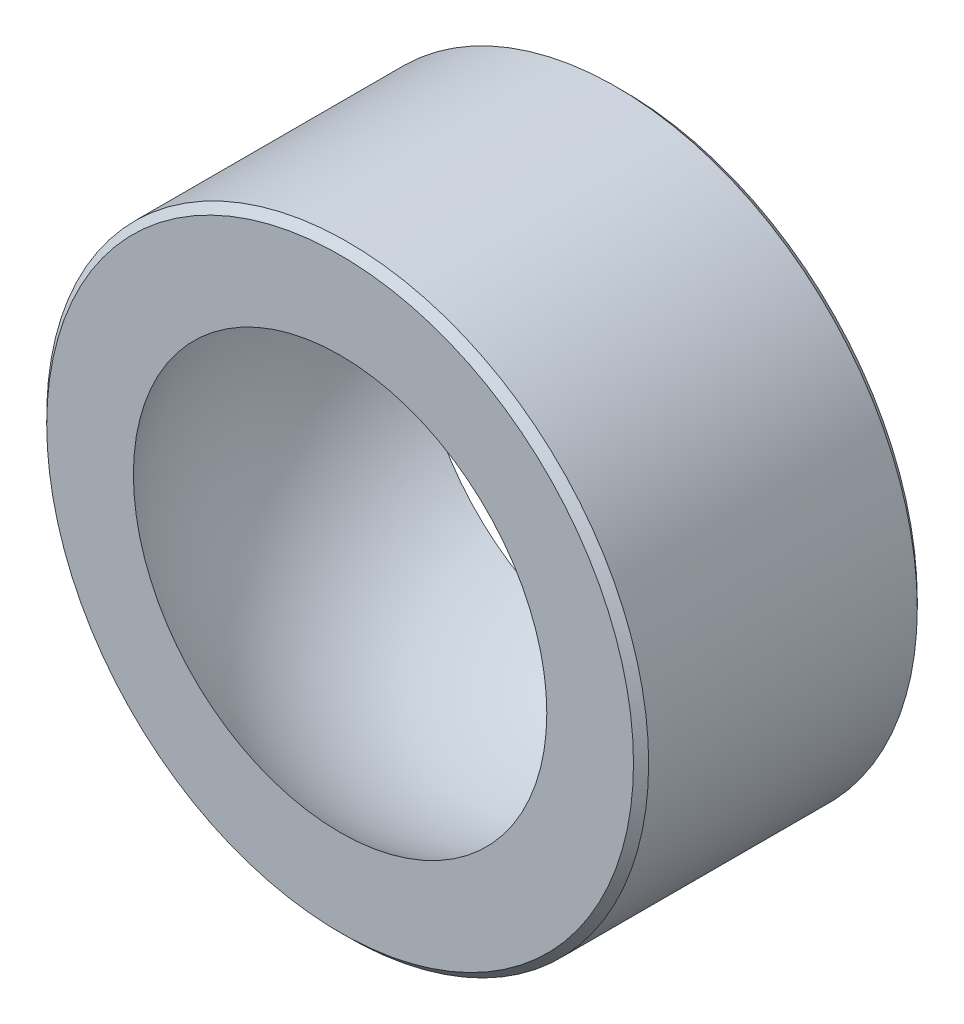
ISO-10303-21;
HEADER;
FILE_DESCRIPTION(('STEP AP214'),'2;1');
FILE_NAME('part.step','',(''),(''),'','','');
FILE_SCHEMA(('AUTOMOTIVE_DESIGN { 1 0 10303 214 1 1 1 1 }'));
ENDSEC;
DATA;
#1=APPLICATION_CONTEXT('core data for automotive mechanical design processes');
#2=APPLICATION_PROTOCOL_DEFINITION('international standard','automotive_design',2000,#1);
#3=PRODUCT_CONTEXT('',#1,'mechanical');
#4=PRODUCT('Part','Part','',(#3));
#5=PRODUCT_RELATED_PRODUCT_CATEGORY('part','',(#4));
#6=PRODUCT_DEFINITION_FORMATION('','',#4);
#7=PRODUCT_DEFINITION_CONTEXT('part definition',#1,'design');
#8=PRODUCT_DEFINITION('design','',#6,#7);
#9=PRODUCT_DEFINITION_SHAPE('','',#8);
#10=(LENGTH_UNIT() NAMED_UNIT(*) SI_UNIT(.MILLI.,.METRE.));
#11=(NAMED_UNIT(*) PLANE_ANGLE_UNIT() SI_UNIT($,.RADIAN.));
#12=(NAMED_UNIT(*) SI_UNIT($,.STERADIAN.) SOLID_ANGLE_UNIT());
#13=UNCERTAINTY_MEASURE_WITH_UNIT(LENGTH_MEASURE(1.E-05),#10,'distance_accuracy_value','');
#14=(GEOMETRIC_REPRESENTATION_CONTEXT(3) GLOBAL_UNCERTAINTY_ASSIGNED_CONTEXT((#13)) GLOBAL_UNIT_ASSIGNED_CONTEXT((#10,
#11,#12)) REPRESENTATION_CONTEXT('',''));
#15=CARTESIAN_POINT('',(0.,0.,0.));
#16=DIRECTION('',(0.,0.,1.));
#17=DIRECTION('',(1.,0.,0.));
#18=AXIS2_PLACEMENT_3D('',#15,#16,#17);
#19=CARTESIAN_POINT('',(0.,0.,-5.6134));
#20=DIRECTION('',(0.,0.,1.));
#21=DIRECTION('',(1.,0.,0.));
#22=AXIS2_PLACEMENT_3D('',#19,#20,#21);
#23=PLANE('',#22);
#24=CARTESIAN_POINT('',(0.,0.,-5.6134));
#25=DIRECTION('',(0.,0.,1.));
#26=DIRECTION('',(1.,0.,0.));
#27=AXIS2_PLACEMENT_3D('',#24,#25,#26);
#28=CIRCLE('',#27,11.60625);
#29=CARTESIAN_POINT('',(11.60625,0.,-5.6134));
#30=VERTEX_POINT('',#29);
#31=EDGE_CURVE('E10',#30,#30,#28,.F.);
#32=ORIENTED_EDGE('',*,*,#31,.T.);
#33=EDGE_LOOP('',(#32));
#34=FACE_BOUND('',#33,.T.);
#35=CARTESIAN_POINT('',(0.,0.,-5.6134));
#36=DIRECTION('',(0.,0.,1.));
#37=DIRECTION('',(1.,0.,0.));
#38=AXIS2_PLACEMENT_3D('',#35,#36,#37);
#39=CIRCLE('',#38,8.17742931060856);
#40=CARTESIAN_POINT('',(8.17742931060856,0.,-5.6134));
#41=VERTEX_POINT('',#40);
#42=EDGE_CURVE('E50',#41,#41,#39,.F.);
#43=ORIENTED_EDGE('',*,*,#42,.F.);
#44=EDGE_LOOP('',(#43));
#45=FACE_BOUND('',#44,.T.);
#46=ADVANCED_FACE('F30',(#34,#45),#23,.F.);
#47=CARTESIAN_POINT('',(0.,0.,5.6134));
#48=DIRECTION('',(0.,0.,1.));
#49=DIRECTION('',(1.,0.,0.));
#50=AXIS2_PLACEMENT_3D('',#47,#48,#49);
#51=PLANE('',#50);
#52=CARTESIAN_POINT('',(0.,0.,5.6134));
#53=DIRECTION('',(0.,0.,1.));
#54=DIRECTION('',(1.,0.,0.));
#55=AXIS2_PLACEMENT_3D('',#52,#53,#54);
#56=CIRCLE('',#55,11.60625);
#57=CARTESIAN_POINT('',(11.60625,0.,5.6134));
#58=VERTEX_POINT('',#57);
#59=EDGE_CURVE('E45',#58,#58,#56,.T.);
#60=ORIENTED_EDGE('',*,*,#59,.T.);
#61=EDGE_LOOP('',(#60));
#62=FACE_BOUND('',#61,.T.);
#63=CARTESIAN_POINT('',(0.,0.,5.6134));
#64=DIRECTION('',(0.,0.,1.));
#65=DIRECTION('',(1.,0.,0.));
#66=AXIS2_PLACEMENT_3D('',#63,#64,#65);
#67=CIRCLE('',#66,8.17742931060856);
#68=CARTESIAN_POINT('',(8.17742931060856,0.,5.6134));
#69=VERTEX_POINT('',#68);
#70=EDGE_CURVE('E51',#69,#69,#67,.F.);
#71=ORIENTED_EDGE('',*,*,#70,.T.);
#72=EDGE_LOOP('',(#71));
#73=FACE_BOUND('',#72,.T.);
#74=ADVANCED_FACE('F60',(#62,#73),#51,.T.);
#75=CARTESIAN_POINT('',(0.,0.,-5.6134));
#76=DIRECTION('',(0.,0.,1.));
#77=DIRECTION('',(1.,0.,0.));
#78=AXIS2_PLACEMENT_3D('',#75,#76,#77);
#79=CYLINDRICAL_SURFACE('',#78,11.90625);
#80=CARTESIAN_POINT('',(0.,0.,5.3134));
#81=DIRECTION('',(0.,0.,1.));
#82=DIRECTION('',(1.,0.,0.));
#83=AXIS2_PLACEMENT_3D('',#80,#81,#82);
#84=CIRCLE('',#83,11.90625);
#85=CARTESIAN_POINT('',(11.90625,0.,5.3134));
#86=VERTEX_POINT('',#85);
#87=EDGE_CURVE('E37',#86,#86,#84,.F.);
#88=ORIENTED_EDGE('',*,*,#87,.T.);
#89=EDGE_LOOP('',(#88));
#90=FACE_BOUND('',#89,.T.);
#91=CARTESIAN_POINT('',(0.,0.,-5.3134));
#92=DIRECTION('',(0.,0.,1.));
#93=DIRECTION('',(1.,0.,0.));
#94=AXIS2_PLACEMENT_3D('',#91,#92,#93);
#95=CIRCLE('',#94,11.90625);
#96=CARTESIAN_POINT('',(11.90625,0.,-5.3134));
#97=VERTEX_POINT('',#96);
#98=EDGE_CURVE('E41',#97,#97,#95,.T.);
#99=ORIENTED_EDGE('',*,*,#98,.T.);
#100=EDGE_LOOP('',(#99));
#101=FACE_BOUND('',#100,.T.);
#102=ADVANCED_FACE('F65',(#90,#101),#79,.T.);
#103=CARTESIAN_POINT('',(0.,0.,0.));
#104=DIRECTION('',(0.,1.,0.));
#105=DIRECTION('',(-1.,0.,0.));
#106=AXIS2_PLACEMENT_3D('',#103,#104,#105);
#107=SPHERICAL_SURFACE('',#106,9.9187);
#108=CARTESIAN_POINT('',(0.,0.,0.));
#109=DIRECTION('',(0.,0.,1.));
#110=DIRECTION('',(1.,0.,0.));
#111=AXIS2_PLACEMENT_3D('',#108,#109,#110);
#112=SPHERICAL_SURFACE('',#111,9.9187);
#113=ORIENTED_EDGE('',*,*,#70,.F.);
#114=EDGE_LOOP('',(#113));
#115=FACE_BOUND('',#114,.T.);
#116=ORIENTED_EDGE('',*,*,#42,.T.);
#117=EDGE_LOOP('',(#116));
#118=FACE_BOUND('',#117,.T.);
#119=ADVANCED_FACE('F57',(#115,#118),#112,.F.);
#120=CARTESIAN_POINT('',(0.,0.,5.6134));
#121=DIRECTION('',(0.,0.,-1.));
#122=DIRECTION('',(-1.,0.,0.));
#123=AXIS2_PLACEMENT_3D('',#120,#121,#122);
#124=CONICAL_SURFACE('',#123,11.60625,0.785398163397443);
#125=ORIENTED_EDGE('',*,*,#87,.F.);
#126=EDGE_LOOP('',(#125));
#127=FACE_BOUND('',#126,.T.);
#128=ORIENTED_EDGE('',*,*,#59,.F.);
#129=EDGE_LOOP('',(#128));
#130=FACE_BOUND('',#129,.T.);
#131=ADVANCED_FACE('F71',(#127,#130),#124,.T.);
#132=CARTESIAN_POINT('',(0.,0.,-5.3134));
#133=DIRECTION('',(0.,0.,1.));
#134=DIRECTION('',(1.,0.,0.));
#135=AXIS2_PLACEMENT_3D('',#132,#133,#134);
#136=CONICAL_SURFACE('',#135,11.90625,0.785398163397448);
#137=ORIENTED_EDGE('',*,*,#31,.F.);
#138=EDGE_LOOP('',(#137));
#139=FACE_BOUND('',#138,.T.);
#140=ORIENTED_EDGE('',*,*,#98,.F.);
#141=EDGE_LOOP('',(#140));
#142=FACE_BOUND('',#141,.T.);
#143=ADVANCED_FACE('F32',(#139,#142),#136,.T.);
#144=CLOSED_SHELL('',(#46,#74,#102,#119,#131,#143));
#145=MANIFOLD_SOLID_BREP('B2',#144);
#146=ADVANCED_BREP_SHAPE_REPRESENTATION('',(#18,#145),#14);
#147=SHAPE_DEFINITION_REPRESENTATION(#9,#146);
ENDSEC;
END-ISO-10303-21;
